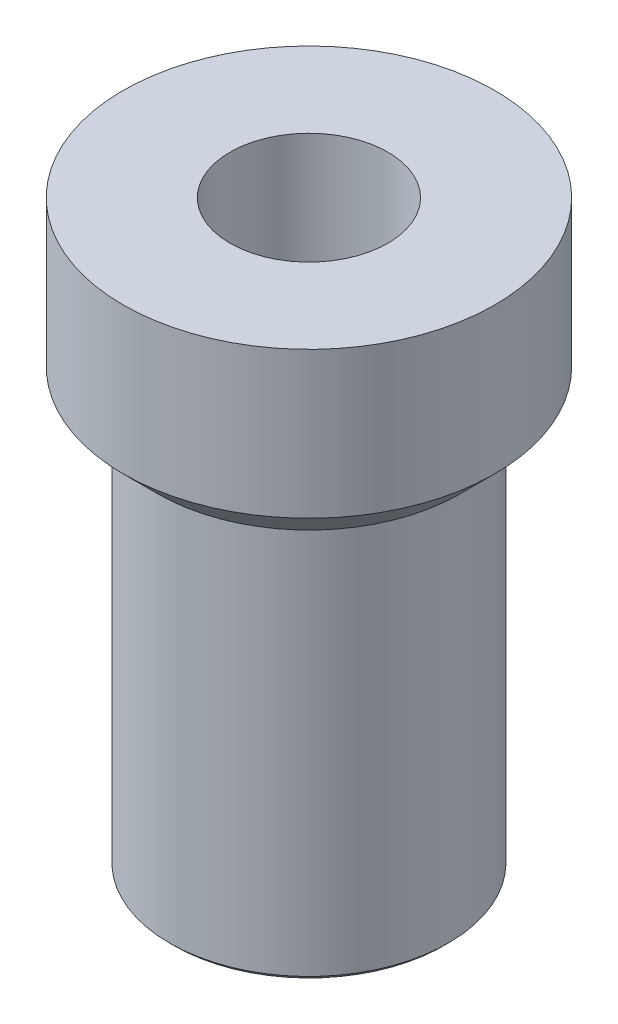
ISO-10303-21;
HEADER;
FILE_DESCRIPTION(('STEP AP214'),'2;1');
FILE_NAME('part.step','',(''),(''),'','','');
FILE_SCHEMA(('AUTOMOTIVE_DESIGN { 1 0 10303 214 1 1 1 1 }'));
ENDSEC;
DATA;
#1=APPLICATION_CONTEXT('core data for automotive mechanical design processes');
#2=APPLICATION_PROTOCOL_DEFINITION('international standard','automotive_design',2000,#1);
#3=PRODUCT_CONTEXT('',#1,'mechanical');
#4=PRODUCT('Part','Part','',(#3));
#5=PRODUCT_RELATED_PRODUCT_CATEGORY('part','',(#4));
#6=PRODUCT_DEFINITION_FORMATION('','',#4);
#7=PRODUCT_DEFINITION_CONTEXT('part definition',#1,'design');
#8=PRODUCT_DEFINITION('design','',#6,#7);
#9=PRODUCT_DEFINITION_SHAPE('','',#8);
#10=(LENGTH_UNIT() NAMED_UNIT(*) SI_UNIT(.MILLI.,.METRE.));
#11=(NAMED_UNIT(*) PLANE_ANGLE_UNIT() SI_UNIT($,.RADIAN.));
#12=(NAMED_UNIT(*) SI_UNIT($,.STERADIAN.) SOLID_ANGLE_UNIT());
#13=UNCERTAINTY_MEASURE_WITH_UNIT(LENGTH_MEASURE(1.E-05),#10,'distance_accuracy_value','');
#14=(GEOMETRIC_REPRESENTATION_CONTEXT(3) GLOBAL_UNCERTAINTY_ASSIGNED_CONTEXT((#13)) GLOBAL_UNIT_ASSIGNED_CONTEXT((#10,
#11,#12)) REPRESENTATION_CONTEXT('',''));
#15=CARTESIAN_POINT('',(0.,0.,0.));
#16=DIRECTION('',(0.,0.,1.));
#17=DIRECTION('',(1.,0.,0.));
#18=AXIS2_PLACEMENT_3D('',#15,#16,#17);
#19=CARTESIAN_POINT('',(-8.,31.056587884008,0.));
#20=DIRECTION('',(0.,1.,0.));
#21=DIRECTION('',(0.,0.,1.));
#22=AXIS2_PLACEMENT_3D('',#19,#20,#21);
#23=PLANE('',#22);
#24=CARTESIAN_POINT('',(0.,31.056587884008,0.));
#25=DIRECTION('',(0.,1.,0.));
#26=DIRECTION('',(0.,0.,1.));
#27=AXIS2_PLACEMENT_3D('',#24,#25,#26);
#28=CIRCLE('',#27,3.4);
#29=CARTESIAN_POINT('',(0.,31.056587884008,3.4));
#30=VERTEX_POINT('',#29);
#31=EDGE_CURVE('E65',#30,#30,#28,.T.);
#32=ORIENTED_EDGE('',*,*,#31,.F.);
#33=EDGE_LOOP('',(#32));
#34=FACE_BOUND('',#33,.T.);
#35=CARTESIAN_POINT('',(0.,31.056587884008,0.));
#36=DIRECTION('',(0.,1.,0.));
#37=DIRECTION('',(0.,0.,1.));
#38=AXIS2_PLACEMENT_3D('',#35,#36,#37);
#39=CIRCLE('',#38,8.);
#40=CARTESIAN_POINT('',(0.,31.056587884008,8.));
#41=VERTEX_POINT('',#40);
#42=EDGE_CURVE('E10',#41,#41,#39,.T.);
#43=ORIENTED_EDGE('',*,*,#42,.T.);
#44=EDGE_LOOP('',(#43));
#45=FACE_BOUND('',#44,.T.);
#46=ADVANCED_FACE('F37',(#34,#45),#23,.T.);
#47=CARTESIAN_POINT('',(0.,31.056587884008,0.));
#48=DIRECTION('',(0.,1.,0.));
#49=DIRECTION('',(0.,0.,1.));
#50=AXIS2_PLACEMENT_3D('',#47,#48,#49);
#51=CYLINDRICAL_SURFACE('',#50,8.);
#52=CARTESIAN_POINT('',(0.,24.756587884008,0.));
#53=DIRECTION('',(0.,1.,0.));
#54=DIRECTION('',(0.,0.,1.));
#55=AXIS2_PLACEMENT_3D('',#52,#53,#54);
#56=CIRCLE('',#55,8.);
#57=CARTESIAN_POINT('',(0.,24.756587884008,8.));
#58=VERTEX_POINT('',#57);
#59=EDGE_CURVE('E43',#58,#58,#56,.T.);
#60=ORIENTED_EDGE('',*,*,#59,.T.);
#61=EDGE_LOOP('',(#60));
#62=FACE_BOUND('',#61,.T.);
#63=ORIENTED_EDGE('',*,*,#42,.F.);
#64=EDGE_LOOP('',(#63));
#65=FACE_BOUND('',#64,.T.);
#66=ADVANCED_FACE('F72',(#62,#65),#51,.T.);
#67=CARTESIAN_POINT('',(0.,24.756587884008,0.));
#68=DIRECTION('',(0.,1.,0.));
#69=DIRECTION('',(0.,0.,1.));
#70=AXIS2_PLACEMENT_3D('',#67,#68,#69);
#71=CONICAL_SURFACE('',#70,8.,0.785398163397448);
#72=CARTESIAN_POINT('',(0.,23.256587884008,0.));
#73=DIRECTION('',(0.,1.,0.));
#74=DIRECTION('',(0.,0.,1.));
#75=AXIS2_PLACEMENT_3D('',#72,#73,#74);
#76=CIRCLE('',#75,6.5);
#77=CARTESIAN_POINT('',(0.,23.256587884008,6.5));
#78=VERTEX_POINT('',#77);
#79=EDGE_CURVE('E47',#78,#78,#76,.T.);
#80=ORIENTED_EDGE('',*,*,#79,.T.);
#81=EDGE_LOOP('',(#80));
#82=FACE_BOUND('',#81,.T.);
#83=ORIENTED_EDGE('',*,*,#59,.F.);
#84=EDGE_LOOP('',(#83));
#85=FACE_BOUND('',#84,.T.);
#86=ADVANCED_FACE('F78',(#82,#85),#71,.T.);
#87=CARTESIAN_POINT('',(-6.5,23.256587884008,0.));
#88=DIRECTION('',(0.,-1.,0.));
#89=DIRECTION('',(0.,0.,-1.));
#90=AXIS2_PLACEMENT_3D('',#87,#88,#89);
#91=PLANE('',#90);
#92=CARTESIAN_POINT('',(0.,23.256587884008,0.));
#93=DIRECTION('',(0.,1.,0.));
#94=DIRECTION('',(0.,0.,1.));
#95=AXIS2_PLACEMENT_3D('',#92,#93,#94);
#96=CIRCLE('',#95,6.);
#97=CARTESIAN_POINT('',(0.,23.256587884008,6.));
#98=VERTEX_POINT('',#97);
#99=EDGE_CURVE('E51',#98,#98,#96,.T.);
#100=ORIENTED_EDGE('',*,*,#99,.T.);
#101=EDGE_LOOP('',(#100));
#102=FACE_BOUND('',#101,.T.);
#103=ORIENTED_EDGE('',*,*,#79,.F.);
#104=EDGE_LOOP('',(#103));
#105=FACE_BOUND('',#104,.T.);
#106=ADVANCED_FACE('F82',(#102,#105),#91,.T.);
#107=CARTESIAN_POINT('',(0.,31.056587884008,0.));
#108=DIRECTION('',(0.,1.,0.));
#109=DIRECTION('',(0.,0.,1.));
#110=AXIS2_PLACEMENT_3D('',#107,#108,#109);
#111=CYLINDRICAL_SURFACE('',#110,5.99999999999999);
#112=CARTESIAN_POINT('',(0.,6.25658788400804,0.));
#113=DIRECTION('',(0.,1.,0.));
#114=DIRECTION('',(0.,0.,1.));
#115=AXIS2_PLACEMENT_3D('',#112,#113,#114);
#116=CIRCLE('',#115,5.99999999999999);
#117=CARTESIAN_POINT('',(0.,6.25658788400804,5.99999999999999));
#118=VERTEX_POINT('',#117);
#119=EDGE_CURVE('E56',#118,#118,#116,.T.);
#120=ORIENTED_EDGE('',*,*,#119,.T.);
#121=EDGE_LOOP('',(#120));
#122=FACE_BOUND('',#121,.T.);
#123=ORIENTED_EDGE('',*,*,#99,.F.);
#124=EDGE_LOOP('',(#123));
#125=FACE_BOUND('',#124,.T.);
#126=ADVANCED_FACE('F89',(#122,#125),#111,.T.);
#127=CARTESIAN_POINT('',(0.,6.25658788400804,0.));
#128=DIRECTION('',(0.,1.,0.));
#129=DIRECTION('',(0.,0.,1.));
#130=AXIS2_PLACEMENT_3D('',#127,#128,#129);
#131=CONICAL_SURFACE('',#130,5.99999999999999,0.785398163397448);
#132=CARTESIAN_POINT('',(0.,6.05658788400804,0.));
#133=DIRECTION('',(0.,1.,0.));
#134=DIRECTION('',(0.,0.,1.));
#135=AXIS2_PLACEMENT_3D('',#132,#133,#134);
#136=CIRCLE('',#135,5.79999999999999);
#137=CARTESIAN_POINT('',(0.,6.05658788400804,5.79999999999999));
#138=VERTEX_POINT('',#137);
#139=EDGE_CURVE('E59',#138,#138,#136,.T.);
#140=ORIENTED_EDGE('',*,*,#139,.T.);
#141=EDGE_LOOP('',(#140));
#142=FACE_BOUND('',#141,.T.);
#143=ORIENTED_EDGE('',*,*,#119,.F.);
#144=EDGE_LOOP('',(#143));
#145=FACE_BOUND('',#144,.T.);
#146=ADVANCED_FACE('F93',(#142,#145),#131,.T.);
#147=CARTESIAN_POINT('',(-5.79999999999999,6.05658788400804,0.));
#148=DIRECTION('',(0.,-1.,0.));
#149=DIRECTION('',(0.,0.,-1.));
#150=AXIS2_PLACEMENT_3D('',#147,#148,#149);
#151=PLANE('',#150);
#152=CARTESIAN_POINT('',(0.,6.05658788400804,0.));
#153=DIRECTION('',(0.,1.,0.));
#154=DIRECTION('',(0.,0.,1.));
#155=AXIS2_PLACEMENT_3D('',#152,#153,#154);
#156=CIRCLE('',#155,3.39999999999999);
#157=CARTESIAN_POINT('',(0.,6.05658788400804,3.39999999999999));
#158=VERTEX_POINT('',#157);
#159=EDGE_CURVE('E62',#158,#158,#156,.T.);
#160=ORIENTED_EDGE('',*,*,#159,.T.);
#161=EDGE_LOOP('',(#160));
#162=FACE_BOUND('',#161,.T.);
#163=ORIENTED_EDGE('',*,*,#139,.F.);
#164=EDGE_LOOP('',(#163));
#165=FACE_BOUND('',#164,.T.);
#166=ADVANCED_FACE('F96',(#162,#165),#151,.T.);
#167=CARTESIAN_POINT('',(0.,31.056587884008,0.));
#168=DIRECTION('',(0.,1.,0.));
#169=DIRECTION('',(0.,0.,1.));
#170=AXIS2_PLACEMENT_3D('',#167,#168,#169);
#171=CYLINDRICAL_SURFACE('',#170,3.4);
#172=ORIENTED_EDGE('',*,*,#159,.F.);
#173=EDGE_LOOP('',(#172));
#174=FACE_BOUND('',#173,.T.);
#175=ORIENTED_EDGE('',*,*,#31,.T.);
#176=EDGE_LOOP('',(#175));
#177=FACE_BOUND('',#176,.T.);
#178=ADVANCED_FACE('F69',(#174,#177),#171,.F.);
#179=CLOSED_SHELL('',(#46,#66,#86,#106,#126,#146,#166,#178));
#180=MANIFOLD_SOLID_BREP('B2',#179);
#181=ADVANCED_BREP_SHAPE_REPRESENTATION('',(#18,#180),#14);
#182=SHAPE_DEFINITION_REPRESENTATION(#9,#181);
ENDSEC;
END-ISO-10303-21;
